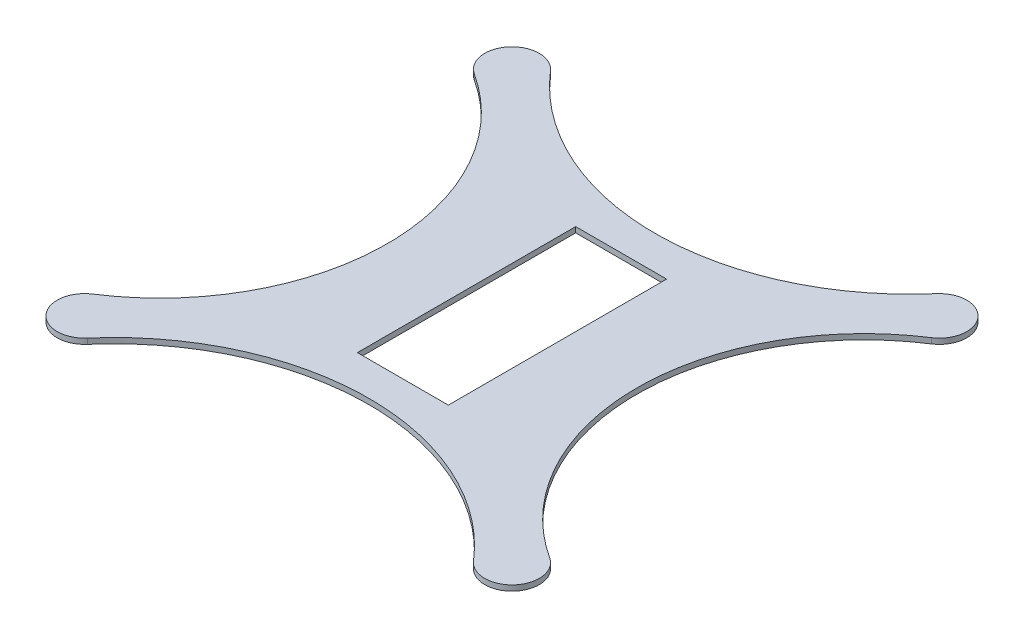
ISO-10303-21;
HEADER;
FILE_DESCRIPTION(('STEP AP214'),'2;1');
FILE_NAME('part.step','',(''),(''),'','','');
FILE_SCHEMA(('AUTOMOTIVE_DESIGN { 1 0 10303 214 1 1 1 1 }'));
ENDSEC;
DATA;
#1=APPLICATION_CONTEXT('core data for automotive mechanical design processes');
#2=APPLICATION_PROTOCOL_DEFINITION('international standard','automotive_design',2000,#1);
#3=PRODUCT_CONTEXT('',#1,'mechanical');
#4=PRODUCT('Part','Part','',(#3));
#5=PRODUCT_RELATED_PRODUCT_CATEGORY('part','',(#4));
#6=PRODUCT_DEFINITION_FORMATION('','',#4);
#7=PRODUCT_DEFINITION_CONTEXT('part definition',#1,'design');
#8=PRODUCT_DEFINITION('design','',#6,#7);
#9=PRODUCT_DEFINITION_SHAPE('','',#8);
#10=(LENGTH_UNIT() NAMED_UNIT(*) SI_UNIT(.MILLI.,.METRE.));
#11=(NAMED_UNIT(*) PLANE_ANGLE_UNIT() SI_UNIT($,.RADIAN.));
#12=(NAMED_UNIT(*) SI_UNIT($,.STERADIAN.) SOLID_ANGLE_UNIT());
#13=UNCERTAINTY_MEASURE_WITH_UNIT(LENGTH_MEASURE(1.E-05),#10,'distance_accuracy_value','');
#14=(GEOMETRIC_REPRESENTATION_CONTEXT(3) GLOBAL_UNCERTAINTY_ASSIGNED_CONTEXT((#13)) GLOBAL_UNIT_ASSIGNED_CONTEXT((#10,
#11,#12)) REPRESENTATION_CONTEXT('',''));
#15=CARTESIAN_POINT('',(0.,0.,0.));
#16=DIRECTION('',(0.,0.,1.));
#17=DIRECTION('',(1.,0.,0.));
#18=AXIS2_PLACEMENT_3D('',#15,#16,#17);
#19=CARTESIAN_POINT('',(155.558343369096,3.,58.75));
#20=DIRECTION('',(0.,1.,0.));
#21=DIRECTION('',(0.,0.,1.));
#22=AXIS2_PLACEMENT_3D('',#19,#20,#21);
#23=PLANE('',#22);
#24=CARTESIAN_POINT('',(193.616686738192,3.,0.));
#25=DIRECTION('',(0.,-1.,0.));
#26=DIRECTION('',(0.,0.,1.));
#27=AXIS2_PLACEMENT_3D('',#24,#25,#26);
#28=CIRCLE('',#27,125.);
#29=CARTESIAN_POINT('',(125.655359293378,3.,104.910714285714));
#30=VERTEX_POINT('',#29);
#31=CARTESIAN_POINT('',(125.655359293378,3.,-104.910714285714));
#32=VERTEX_POINT('',#31);
#33=EDGE_CURVE('E162',#30,#32,#28,.T.);
#34=ORIENTED_EDGE('',*,*,#33,.T.);
#35=CARTESIAN_POINT('',(117.5,3.,-117.5));
#36=DIRECTION('',(0.,1.,0.));
#37=DIRECTION('',(0.,0.,1.));
#38=AXIS2_PLACEMENT_3D('',#35,#36,#37);
#39=CIRCLE('',#38,15.);
#40=CARTESIAN_POINT('',(106.129032258064,3.,-127.282693525398));
#41=VERTEX_POINT('',#40);
#42=EDGE_CURVE('E165',#32,#41,#39,.T.);
#43=ORIENTED_EDGE('',*,*,#42,.T.);
#44=CARTESIAN_POINT('',(0.,3.,-218.587833095779));
#45=DIRECTION('',(0.,-1.,0.));
#46=DIRECTION('',(0.,0.,1.));
#47=AXIS2_PLACEMENT_3D('',#44,#45,#46);
#48=CIRCLE('',#47,140.);
#49=CARTESIAN_POINT('',(-106.129032258065,3.,-127.282693525398));
#50=VERTEX_POINT('',#49);
#51=EDGE_CURVE('E168',#41,#50,#48,.T.);
#52=ORIENTED_EDGE('',*,*,#51,.T.);
#53=CARTESIAN_POINT('',(-117.5,3.,-117.5));
#54=DIRECTION('',(0.,1.,0.));
#55=DIRECTION('',(0.,0.,1.));
#56=AXIS2_PLACEMENT_3D('',#53,#54,#55);
#57=CIRCLE('',#56,15.);
#58=CARTESIAN_POINT('',(-125.655359293378,3.,-104.910714285714));
#59=VERTEX_POINT('',#58);
#60=EDGE_CURVE('E170',#50,#59,#57,.T.);
#61=ORIENTED_EDGE('',*,*,#60,.T.);
#62=CARTESIAN_POINT('',(-193.616686738192,3.,0.));
#63=DIRECTION('',(0.,-1.,0.));
#64=DIRECTION('',(0.,0.,-1.));
#65=AXIS2_PLACEMENT_3D('',#62,#63,#64);
#66=CIRCLE('',#65,125.);
#67=CARTESIAN_POINT('',(-125.655359293378,3.,104.910714285714));
#68=VERTEX_POINT('',#67);
#69=EDGE_CURVE('E172',#59,#68,#66,.T.);
#70=ORIENTED_EDGE('',*,*,#69,.T.);
#71=CARTESIAN_POINT('',(-117.5,3.,117.5));
#72=DIRECTION('',(0.,1.,0.));
#73=DIRECTION('',(0.,0.,1.));
#74=AXIS2_PLACEMENT_3D('',#71,#72,#73);
#75=CIRCLE('',#74,15.);
#76=CARTESIAN_POINT('',(-106.129032258065,3.,127.282693525398));
#77=VERTEX_POINT('',#76);
#78=EDGE_CURVE('E174',#68,#77,#75,.T.);
#79=ORIENTED_EDGE('',*,*,#78,.T.);
#80=CARTESIAN_POINT('',(0.,3.,218.587833095779));
#81=DIRECTION('',(0.,-1.,0.));
#82=DIRECTION('',(0.,0.,-1.));
#83=AXIS2_PLACEMENT_3D('',#80,#81,#82);
#84=CIRCLE('',#83,140.);
#85=CARTESIAN_POINT('',(106.129032258064,3.,127.282693525398));
#86=VERTEX_POINT('',#85);
#87=EDGE_CURVE('E176',#77,#86,#84,.T.);
#88=ORIENTED_EDGE('',*,*,#87,.T.);
#89=CARTESIAN_POINT('',(117.5,3.,117.5));
#90=DIRECTION('',(0.,1.,0.));
#91=DIRECTION('',(0.,0.,1.));
#92=AXIS2_PLACEMENT_3D('',#89,#90,#91);
#93=CIRCLE('',#92,15.);
#94=EDGE_CURVE('E178',#86,#30,#93,.T.);
#95=ORIENTED_EDGE('',*,*,#94,.T.);
#96=EDGE_LOOP('',(#34,#43,#52,#61,#70,#79,#88,#95));
#97=FACE_BOUND('',#96,.T.);
#98=DIRECTION('',(1.,0.,0.));
#99=VECTOR('',#98,1.);
#100=CARTESIAN_POINT('',(25.,3.,60.));
#101=LINE('',#100,#99);
#102=CARTESIAN_POINT('',(-25.,3.,60.));
#103=VERTEX_POINT('',#102);
#104=CARTESIAN_POINT('',(25.,3.,60.));
#105=VERTEX_POINT('',#104);
#106=EDGE_CURVE('E134',#103,#105,#101,.T.);
#107=ORIENTED_EDGE('',*,*,#106,.F.);
#108=DIRECTION('',(0.,0.,1.));
#109=VECTOR('',#108,1.);
#110=CARTESIAN_POINT('',(-25.,3.,60.));
#111=LINE('',#110,#109);
#112=CARTESIAN_POINT('',(-25.,3.,-60.));
#113=VERTEX_POINT('',#112);
#114=EDGE_CURVE('E126',#113,#103,#111,.T.);
#115=ORIENTED_EDGE('',*,*,#114,.F.);
#116=DIRECTION('',(-1.,0.,0.));
#117=VECTOR('',#116,1.);
#118=CARTESIAN_POINT('',(25.,3.,-60.));
#119=LINE('',#118,#117);
#120=CARTESIAN_POINT('',(25.,3.,-60.));
#121=VERTEX_POINT('',#120);
#122=EDGE_CURVE('E148',#121,#113,#119,.T.);
#123=ORIENTED_EDGE('',*,*,#122,.F.);
#124=DIRECTION('',(0.,0.,-1.));
#125=VECTOR('',#124,1.);
#126=CARTESIAN_POINT('',(25.,3.,60.));
#127=LINE('',#126,#125);
#128=EDGE_CURVE('E146',#105,#121,#127,.T.);
#129=ORIENTED_EDGE('',*,*,#128,.F.);
#130=EDGE_LOOP('',(#107,#115,#123,#129));
#131=FACE_BOUND('',#130,.T.);
#132=ADVANCED_FACE('F37',(#97,#131),#23,.T.);
#133=CARTESIAN_POINT('',(155.558343369096,0.,58.75));
#134=DIRECTION('',(0.,1.,0.));
#135=DIRECTION('',(0.,0.,1.));
#136=AXIS2_PLACEMENT_3D('',#133,#134,#135);
#137=PLANE('',#136);
#138=CARTESIAN_POINT('',(193.616686738192,0.,0.));
#139=DIRECTION('',(0.,-1.,0.));
#140=DIRECTION('',(0.,0.,1.));
#141=AXIS2_PLACEMENT_3D('',#138,#139,#140);
#142=CIRCLE('',#141,125.);
#143=CARTESIAN_POINT('',(125.655359293378,0.,104.910714285714));
#144=VERTEX_POINT('',#143);
#145=CARTESIAN_POINT('',(125.655359293378,0.,-104.910714285714));
#146=VERTEX_POINT('',#145);
#147=EDGE_CURVE('E142',#144,#146,#142,.T.);
#148=ORIENTED_EDGE('',*,*,#147,.F.);
#149=CARTESIAN_POINT('',(117.5,0.,117.5));
#150=DIRECTION('',(0.,1.,0.));
#151=DIRECTION('',(0.,0.,1.));
#152=AXIS2_PLACEMENT_3D('',#149,#150,#151);
#153=CIRCLE('',#152,15.);
#154=CARTESIAN_POINT('',(106.129032258064,0.,127.282693525398));
#155=VERTEX_POINT('',#154);
#156=EDGE_CURVE('E166',#155,#144,#153,.T.);
#157=ORIENTED_EDGE('',*,*,#156,.F.);
#158=CARTESIAN_POINT('',(0.,0.,218.587833095779));
#159=DIRECTION('',(0.,-1.,0.));
#160=DIRECTION('',(0.,0.,-1.));
#161=AXIS2_PLACEMENT_3D('',#158,#159,#160);
#162=CIRCLE('',#161,140.);
#163=CARTESIAN_POINT('',(-106.129032258065,0.,127.282693525398));
#164=VERTEX_POINT('',#163);
#165=EDGE_CURVE('E193',#164,#155,#162,.T.);
#166=ORIENTED_EDGE('',*,*,#165,.F.);
#167=CARTESIAN_POINT('',(-117.5,0.,117.5));
#168=DIRECTION('',(0.,1.,0.));
#169=DIRECTION('',(0.,0.,1.));
#170=AXIS2_PLACEMENT_3D('',#167,#168,#169);
#171=CIRCLE('',#170,15.);
#172=CARTESIAN_POINT('',(-125.655359293378,0.,104.910714285714));
#173=VERTEX_POINT('',#172);
#174=EDGE_CURVE('E191',#173,#164,#171,.T.);
#175=ORIENTED_EDGE('',*,*,#174,.F.);
#176=CARTESIAN_POINT('',(-193.616686738192,0.,0.));
#177=DIRECTION('',(0.,-1.,0.));
#178=DIRECTION('',(0.,0.,-1.));
#179=AXIS2_PLACEMENT_3D('',#176,#177,#178);
#180=CIRCLE('',#179,125.);
#181=CARTESIAN_POINT('',(-125.655359293378,0.,-104.910714285714));
#182=VERTEX_POINT('',#181);
#183=EDGE_CURVE('E189',#182,#173,#180,.T.);
#184=ORIENTED_EDGE('',*,*,#183,.F.);
#185=CARTESIAN_POINT('',(-117.5,0.,-117.5));
#186=DIRECTION('',(0.,1.,0.));
#187=DIRECTION('',(0.,0.,1.));
#188=AXIS2_PLACEMENT_3D('',#185,#186,#187);
#189=CIRCLE('',#188,15.);
#190=CARTESIAN_POINT('',(-106.129032258065,0.,-127.282693525398));
#191=VERTEX_POINT('',#190);
#192=EDGE_CURVE('E187',#191,#182,#189,.T.);
#193=ORIENTED_EDGE('',*,*,#192,.F.);
#194=CARTESIAN_POINT('',(0.,0.,-218.587833095779));
#195=DIRECTION('',(0.,-1.,0.));
#196=DIRECTION('',(0.,0.,1.));
#197=AXIS2_PLACEMENT_3D('',#194,#195,#196);
#198=CIRCLE('',#197,140.);
#199=CARTESIAN_POINT('',(106.129032258064,0.,-127.282693525398));
#200=VERTEX_POINT('',#199);
#201=EDGE_CURVE('E185',#200,#191,#198,.T.);
#202=ORIENTED_EDGE('',*,*,#201,.F.);
#203=CARTESIAN_POINT('',(117.5,0.,-117.5));
#204=DIRECTION('',(0.,1.,0.));
#205=DIRECTION('',(0.,0.,1.));
#206=AXIS2_PLACEMENT_3D('',#203,#204,#205);
#207=CIRCLE('',#206,15.);
#208=EDGE_CURVE('E183',#146,#200,#207,.T.);
#209=ORIENTED_EDGE('',*,*,#208,.F.);
#210=EDGE_LOOP('',(#148,#157,#166,#175,#184,#193,#202,#209));
#211=FACE_BOUND('',#210,.T.);
#212=DIRECTION('',(0.,0.,1.));
#213=VECTOR('',#212,1.);
#214=CARTESIAN_POINT('',(-25.,0.,60.));
#215=LINE('',#214,#213);
#216=CARTESIAN_POINT('',(-25.,0.,-60.));
#217=VERTEX_POINT('',#216);
#218=CARTESIAN_POINT('',(-25.,0.,60.));
#219=VERTEX_POINT('',#218);
#220=EDGE_CURVE('E60',#217,#219,#215,.T.);
#221=ORIENTED_EDGE('',*,*,#220,.T.);
#222=DIRECTION('',(1.,0.,0.));
#223=VECTOR('',#222,1.);
#224=CARTESIAN_POINT('',(25.,0.,60.));
#225=LINE('',#224,#223);
#226=CARTESIAN_POINT('',(25.,0.,60.));
#227=VERTEX_POINT('',#226);
#228=EDGE_CURVE('E141',#219,#227,#225,.T.);
#229=ORIENTED_EDGE('',*,*,#228,.T.);
#230=DIRECTION('',(0.,0.,-1.));
#231=VECTOR('',#230,1.);
#232=CARTESIAN_POINT('',(25.,0.,60.));
#233=LINE('',#232,#231);
#234=CARTESIAN_POINT('',(25.,0.,-60.));
#235=VERTEX_POINT('',#234);
#236=EDGE_CURVE('E154',#227,#235,#233,.T.);
#237=ORIENTED_EDGE('',*,*,#236,.T.);
#238=DIRECTION('',(-1.,0.,0.));
#239=VECTOR('',#238,1.);
#240=CARTESIAN_POINT('',(25.,0.,-60.));
#241=LINE('',#240,#239);
#242=EDGE_CURVE('E135',#235,#217,#241,.T.);
#243=ORIENTED_EDGE('',*,*,#242,.T.);
#244=EDGE_LOOP('',(#221,#229,#237,#243));
#245=FACE_BOUND('',#244,.T.);
#246=ADVANCED_FACE('F223',(#211,#245),#137,.F.);
#247=CARTESIAN_POINT('',(193.616686738192,3.,0.));
#248=DIRECTION('',(0.,-1.,0.));
#249=DIRECTION('',(0.,0.,-1.));
#250=AXIS2_PLACEMENT_3D('',#247,#248,#249);
#251=CYLINDRICAL_SURFACE('',#250,125.);
#252=ORIENTED_EDGE('',*,*,#147,.T.);
#253=DIRECTION('',(0.,-1.,0.));
#254=VECTOR('',#253,1.);
#255=CARTESIAN_POINT('',(125.655359293378,3.,-104.910714285714));
#256=LINE('',#255,#254);
#257=EDGE_CURVE('E11',#32,#146,#256,.T.);
#258=ORIENTED_EDGE('',*,*,#257,.F.);
#259=ORIENTED_EDGE('',*,*,#33,.F.);
#260=DIRECTION('',(0.,-1.,0.));
#261=VECTOR('',#260,1.);
#262=CARTESIAN_POINT('',(125.655359293378,3.,104.910714285714));
#263=LINE('',#262,#261);
#264=EDGE_CURVE('E180',#30,#144,#263,.T.);
#265=ORIENTED_EDGE('',*,*,#264,.T.);
#266=EDGE_LOOP('',(#252,#258,#259,#265));
#267=FACE_BOUND('',#266,.T.);
#268=ADVANCED_FACE('F39',(#267),#251,.F.);
#269=CARTESIAN_POINT('',(117.5,3.,-117.5));
#270=DIRECTION('',(0.,-1.,0.));
#271=DIRECTION('',(0.,0.,-1.));
#272=AXIS2_PLACEMENT_3D('',#269,#270,#271);
#273=CYLINDRICAL_SURFACE('',#272,15.);
#274=ORIENTED_EDGE('',*,*,#208,.T.);
#275=DIRECTION('',(0.,-1.,0.));
#276=VECTOR('',#275,1.);
#277=CARTESIAN_POINT('',(106.129032258064,3.,-127.282693525398));
#278=LINE('',#277,#276);
#279=EDGE_CURVE('E45',#41,#200,#278,.T.);
#280=ORIENTED_EDGE('',*,*,#279,.F.);
#281=ORIENTED_EDGE('',*,*,#42,.F.);
#282=ORIENTED_EDGE('',*,*,#257,.T.);
#283=EDGE_LOOP('',(#274,#280,#281,#282));
#284=FACE_BOUND('',#283,.T.);
#285=ADVANCED_FACE('F240',(#284),#273,.T.);
#286=CARTESIAN_POINT('',(0.,3.,-218.587833095779));
#287=DIRECTION('',(0.,-1.,0.));
#288=DIRECTION('',(0.,0.,-1.));
#289=AXIS2_PLACEMENT_3D('',#286,#287,#288);
#290=CYLINDRICAL_SURFACE('',#289,140.);
#291=ORIENTED_EDGE('',*,*,#201,.T.);
#292=DIRECTION('',(0.,-1.,0.));
#293=VECTOR('',#292,1.);
#294=CARTESIAN_POINT('',(-106.129032258065,3.,-127.282693525398));
#295=LINE('',#294,#293);
#296=EDGE_CURVE('E210',#50,#191,#295,.T.);
#297=ORIENTED_EDGE('',*,*,#296,.F.);
#298=ORIENTED_EDGE('',*,*,#51,.F.);
#299=ORIENTED_EDGE('',*,*,#279,.T.);
#300=EDGE_LOOP('',(#291,#297,#298,#299));
#301=FACE_BOUND('',#300,.T.);
#302=ADVANCED_FACE('F217',(#301),#290,.F.);
#303=CARTESIAN_POINT('',(-117.5,3.,-117.5));
#304=DIRECTION('',(0.,-1.,0.));
#305=DIRECTION('',(0.,0.,-1.));
#306=AXIS2_PLACEMENT_3D('',#303,#304,#305);
#307=CYLINDRICAL_SURFACE('',#306,15.);
#308=ORIENTED_EDGE('',*,*,#192,.T.);
#309=DIRECTION('',(0.,-1.,0.));
#310=VECTOR('',#309,1.);
#311=CARTESIAN_POINT('',(-125.655359293378,3.,-104.910714285714));
#312=LINE('',#311,#310);
#313=EDGE_CURVE('E207',#59,#182,#312,.T.);
#314=ORIENTED_EDGE('',*,*,#313,.F.);
#315=ORIENTED_EDGE('',*,*,#60,.F.);
#316=ORIENTED_EDGE('',*,*,#296,.T.);
#317=EDGE_LOOP('',(#308,#314,#315,#316));
#318=FACE_BOUND('',#317,.T.);
#319=ADVANCED_FACE('F229',(#318),#307,.T.);
#320=CARTESIAN_POINT('',(-193.616686738192,3.,0.));
#321=DIRECTION('',(0.,-1.,0.));
#322=DIRECTION('',(0.,0.,-1.));
#323=AXIS2_PLACEMENT_3D('',#320,#321,#322);
#324=CYLINDRICAL_SURFACE('',#323,125.);
#325=ORIENTED_EDGE('',*,*,#183,.T.);
#326=DIRECTION('',(0.,-1.,0.));
#327=VECTOR('',#326,1.);
#328=CARTESIAN_POINT('',(-125.655359293378,3.,104.910714285714));
#329=LINE('',#328,#327);
#330=EDGE_CURVE('E204',#68,#173,#329,.T.);
#331=ORIENTED_EDGE('',*,*,#330,.F.);
#332=ORIENTED_EDGE('',*,*,#69,.F.);
#333=ORIENTED_EDGE('',*,*,#313,.T.);
#334=EDGE_LOOP('',(#325,#331,#332,#333));
#335=FACE_BOUND('',#334,.T.);
#336=ADVANCED_FACE('F233',(#335),#324,.F.);
#337=CARTESIAN_POINT('',(-117.5,3.,117.5));
#338=DIRECTION('',(0.,-1.,0.));
#339=DIRECTION('',(0.,0.,-1.));
#340=AXIS2_PLACEMENT_3D('',#337,#338,#339);
#341=CYLINDRICAL_SURFACE('',#340,15.);
#342=ORIENTED_EDGE('',*,*,#174,.T.);
#343=DIRECTION('',(0.,-1.,0.));
#344=VECTOR('',#343,1.);
#345=CARTESIAN_POINT('',(-106.129032258065,3.,127.282693525398));
#346=LINE('',#345,#344);
#347=EDGE_CURVE('E201',#77,#164,#346,.T.);
#348=ORIENTED_EDGE('',*,*,#347,.F.);
#349=ORIENTED_EDGE('',*,*,#78,.F.);
#350=ORIENTED_EDGE('',*,*,#330,.T.);
#351=EDGE_LOOP('',(#342,#348,#349,#350));
#352=FACE_BOUND('',#351,.T.);
#353=ADVANCED_FACE('F253',(#352),#341,.T.);
#354=CARTESIAN_POINT('',(0.,3.,218.587833095779));
#355=DIRECTION('',(0.,-1.,0.));
#356=DIRECTION('',(0.,0.,-1.));
#357=AXIS2_PLACEMENT_3D('',#354,#355,#356);
#358=CYLINDRICAL_SURFACE('',#357,140.);
#359=ORIENTED_EDGE('',*,*,#165,.T.);
#360=DIRECTION('',(0.,-1.,0.));
#361=VECTOR('',#360,1.);
#362=CARTESIAN_POINT('',(106.129032258064,3.,127.282693525398));
#363=LINE('',#362,#361);
#364=EDGE_CURVE('E198',#86,#155,#363,.T.);
#365=ORIENTED_EDGE('',*,*,#364,.F.);
#366=ORIENTED_EDGE('',*,*,#87,.F.);
#367=ORIENTED_EDGE('',*,*,#347,.T.);
#368=EDGE_LOOP('',(#359,#365,#366,#367));
#369=FACE_BOUND('',#368,.T.);
#370=ADVANCED_FACE('F251',(#369),#358,.F.);
#371=CARTESIAN_POINT('',(117.5,3.,117.5));
#372=DIRECTION('',(0.,-1.,0.));
#373=DIRECTION('',(0.,0.,-1.));
#374=AXIS2_PLACEMENT_3D('',#371,#372,#373);
#375=CYLINDRICAL_SURFACE('',#374,15.);
#376=ORIENTED_EDGE('',*,*,#156,.T.);
#377=ORIENTED_EDGE('',*,*,#264,.F.);
#378=ORIENTED_EDGE('',*,*,#94,.F.);
#379=ORIENTED_EDGE('',*,*,#364,.T.);
#380=EDGE_LOOP('',(#376,#377,#378,#379));
#381=FACE_BOUND('',#380,.T.);
#382=ADVANCED_FACE('F246',(#381),#375,.T.);
#383=CARTESIAN_POINT('',(-25.,3.,60.));
#384=DIRECTION('',(1.,0.,0.));
#385=DIRECTION('',(0.,0.,-1.));
#386=AXIS2_PLACEMENT_3D('',#383,#384,#385);
#387=PLANE('',#386);
#388=ORIENTED_EDGE('',*,*,#220,.F.);
#389=DIRECTION('',(0.,-1.,0.));
#390=VECTOR('',#389,1.);
#391=CARTESIAN_POINT('',(-25.,3.,-60.));
#392=LINE('',#391,#390);
#393=EDGE_CURVE('E130',#113,#217,#392,.T.);
#394=ORIENTED_EDGE('',*,*,#393,.F.);
#395=ORIENTED_EDGE('',*,*,#114,.T.);
#396=DIRECTION('',(0.,-1.,0.));
#397=VECTOR('',#396,1.);
#398=CARTESIAN_POINT('',(-25.,3.,60.));
#399=LINE('',#398,#397);
#400=EDGE_CURVE('E129',#103,#219,#399,.T.);
#401=ORIENTED_EDGE('',*,*,#400,.T.);
#402=EDGE_LOOP('',(#388,#394,#395,#401));
#403=FACE_BOUND('',#402,.T.);
#404=ADVANCED_FACE('F128',(#403),#387,.T.);
#405=CARTESIAN_POINT('',(25.,3.,60.));
#406=DIRECTION('',(0.,0.,-1.));
#407=DIRECTION('',(-1.,0.,0.));
#408=AXIS2_PLACEMENT_3D('',#405,#406,#407);
#409=PLANE('',#408);
#410=ORIENTED_EDGE('',*,*,#228,.F.);
#411=ORIENTED_EDGE('',*,*,#400,.F.);
#412=ORIENTED_EDGE('',*,*,#106,.T.);
#413=DIRECTION('',(0.,-1.,0.));
#414=VECTOR('',#413,1.);
#415=CARTESIAN_POINT('',(25.,3.,60.));
#416=LINE('',#415,#414);
#417=EDGE_CURVE('E143',#105,#227,#416,.T.);
#418=ORIENTED_EDGE('',*,*,#417,.T.);
#419=EDGE_LOOP('',(#410,#411,#412,#418));
#420=FACE_BOUND('',#419,.T.);
#421=ADVANCED_FACE('F138',(#420),#409,.T.);
#422=CARTESIAN_POINT('',(25.,3.,60.));
#423=DIRECTION('',(-1.,0.,0.));
#424=DIRECTION('',(0.,0.,1.));
#425=AXIS2_PLACEMENT_3D('',#422,#423,#424);
#426=PLANE('',#425);
#427=ORIENTED_EDGE('',*,*,#236,.F.);
#428=ORIENTED_EDGE('',*,*,#417,.F.);
#429=ORIENTED_EDGE('',*,*,#128,.T.);
#430=DIRECTION('',(0.,-1.,0.));
#431=VECTOR('',#430,1.);
#432=CARTESIAN_POINT('',(25.,3.,-60.));
#433=LINE('',#432,#431);
#434=EDGE_CURVE('E52',#121,#235,#433,.T.);
#435=ORIENTED_EDGE('',*,*,#434,.T.);
#436=EDGE_LOOP('',(#427,#428,#429,#435));
#437=FACE_BOUND('',#436,.T.);
#438=ADVANCED_FACE('F278',(#437),#426,.T.);
#439=CARTESIAN_POINT('',(25.,3.,-60.));
#440=DIRECTION('',(0.,0.,1.));
#441=DIRECTION('',(1.,0.,0.));
#442=AXIS2_PLACEMENT_3D('',#439,#440,#441);
#443=PLANE('',#442);
#444=ORIENTED_EDGE('',*,*,#242,.F.);
#445=ORIENTED_EDGE('',*,*,#434,.F.);
#446=ORIENTED_EDGE('',*,*,#122,.T.);
#447=ORIENTED_EDGE('',*,*,#393,.T.);
#448=EDGE_LOOP('',(#444,#445,#446,#447));
#449=FACE_BOUND('',#448,.T.);
#450=ADVANCED_FACE('F282',(#449),#443,.T.);
#451=CLOSED_SHELL('',(#132,#246,#268,#285,#302,#319,#336,#353,#370,#382,#404,#421,#438,#450));
#452=MANIFOLD_SOLID_BREP('B2',#451);
#453=ADVANCED_BREP_SHAPE_REPRESENTATION('',(#18,#452),#14);
#454=SHAPE_DEFINITION_REPRESENTATION(#9,#453);
ENDSEC;
END-ISO-10303-21;
